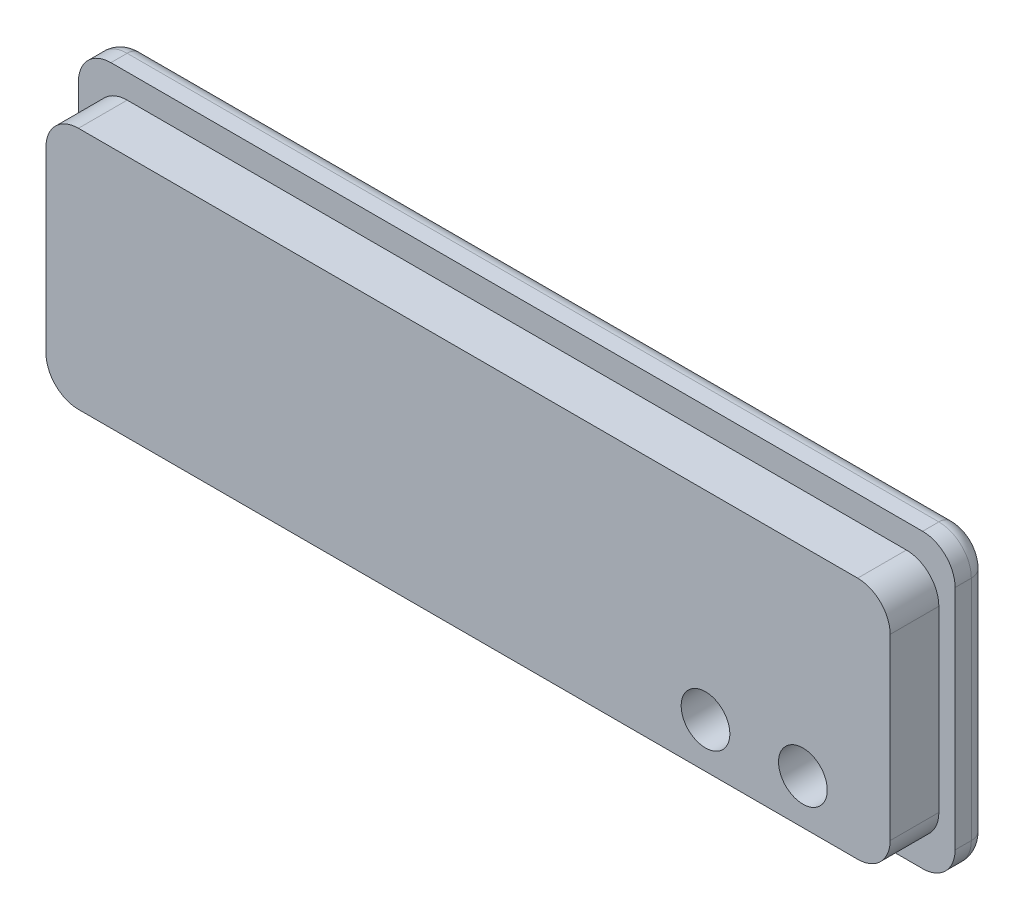
ISO-10303-21;
HEADER;
FILE_DESCRIPTION(('STEP AP214'),'2;1');
FILE_NAME('part.step','',(''),(''),'','','');
FILE_SCHEMA(('AUTOMOTIVE_DESIGN { 1 0 10303 214 1 1 1 1 }'));
ENDSEC;
DATA;
#1=APPLICATION_CONTEXT('core data for automotive mechanical design processes');
#2=APPLICATION_PROTOCOL_DEFINITION('international standard','automotive_design',2000,#1);
#3=PRODUCT_CONTEXT('',#1,'mechanical');
#4=PRODUCT('Part','Part','',(#3));
#5=PRODUCT_RELATED_PRODUCT_CATEGORY('part','',(#4));
#6=PRODUCT_DEFINITION_FORMATION('','',#4);
#7=PRODUCT_DEFINITION_CONTEXT('part definition',#1,'design');
#8=PRODUCT_DEFINITION('design','',#6,#7);
#9=PRODUCT_DEFINITION_SHAPE('','',#8);
#10=(LENGTH_UNIT() NAMED_UNIT(*) SI_UNIT(.MILLI.,.METRE.));
#11=(NAMED_UNIT(*) PLANE_ANGLE_UNIT() SI_UNIT($,.RADIAN.));
#12=(NAMED_UNIT(*) SI_UNIT($,.STERADIAN.) SOLID_ANGLE_UNIT());
#13=UNCERTAINTY_MEASURE_WITH_UNIT(LENGTH_MEASURE(1.E-05),#10,'distance_accuracy_value','');
#14=(GEOMETRIC_REPRESENTATION_CONTEXT(3) GLOBAL_UNCERTAINTY_ASSIGNED_CONTEXT((#13)) GLOBAL_UNIT_ASSIGNED_CONTEXT((#10,
#11,#12)) REPRESENTATION_CONTEXT('',''));
#15=CARTESIAN_POINT('',(0.,0.,0.));
#16=DIRECTION('',(0.,0.,1.));
#17=DIRECTION('',(1.,0.,0.));
#18=AXIS2_PLACEMENT_3D('',#15,#16,#17);
#19=CARTESIAN_POINT('',(-25.,-7.,2.));
#20=DIRECTION('',(0.,0.,1.));
#21=DIRECTION('',(1.,0.,0.));
#22=AXIS2_PLACEMENT_3D('',#19,#20,#21);
#23=PLANE('',#22);
#24=CARTESIAN_POINT('',(-25.,-7.,2.));
#25=DIRECTION('',(0.,0.,1.));
#26=DIRECTION('',(1.,0.,0.));
#27=AXIS2_PLACEMENT_3D('',#24,#25,#26);
#28=CIRCLE('',#27,2.);
#29=CARTESIAN_POINT('',(-27.,-6.99999999999999,2.));
#30=VERTEX_POINT('',#29);
#31=CARTESIAN_POINT('',(-25.,-9.,2.));
#32=VERTEX_POINT('',#31);
#33=EDGE_CURVE('E197',#30,#32,#28,.T.);
#34=ORIENTED_EDGE('',*,*,#33,.T.);
#35=DIRECTION('',(1.,0.,0.));
#36=VECTOR('',#35,1.);
#37=CARTESIAN_POINT('',(25.,-9.,2.));
#38=LINE('',#37,#36);
#39=CARTESIAN_POINT('',(25.,-9.,2.));
#40=VERTEX_POINT('',#39);
#41=EDGE_CURVE('E200',#32,#40,#38,.T.);
#42=ORIENTED_EDGE('',*,*,#41,.T.);
#43=CARTESIAN_POINT('',(25.,-7.,2.));
#44=DIRECTION('',(0.,0.,1.));
#45=DIRECTION('',(-1.,0.,0.));
#46=AXIS2_PLACEMENT_3D('',#43,#44,#45);
#47=CIRCLE('',#46,2.);
#48=CARTESIAN_POINT('',(27.,-6.99999999999999,2.));
#49=VERTEX_POINT('',#48);
#50=EDGE_CURVE('E207',#40,#49,#47,.T.);
#51=ORIENTED_EDGE('',*,*,#50,.T.);
#52=DIRECTION('',(0.,1.,0.));
#53=VECTOR('',#52,1.);
#54=CARTESIAN_POINT('',(27.,6.99999999999999,2.));
#55=LINE('',#54,#53);
#56=CARTESIAN_POINT('',(27.,6.99999999999999,2.));
#57=VERTEX_POINT('',#56);
#58=EDGE_CURVE('E209',#49,#57,#55,.T.);
#59=ORIENTED_EDGE('',*,*,#58,.T.);
#60=CARTESIAN_POINT('',(25.,7.,2.));
#61=DIRECTION('',(0.,0.,1.));
#62=DIRECTION('',(-1.,0.,0.));
#63=AXIS2_PLACEMENT_3D('',#60,#61,#62);
#64=CIRCLE('',#63,2.);
#65=CARTESIAN_POINT('',(25.,9.,2.));
#66=VERTEX_POINT('',#65);
#67=EDGE_CURVE('E211',#57,#66,#64,.T.);
#68=ORIENTED_EDGE('',*,*,#67,.T.);
#69=DIRECTION('',(-1.,0.,0.));
#70=VECTOR('',#69,1.);
#71=CARTESIAN_POINT('',(25.,9.,2.));
#72=LINE('',#71,#70);
#73=CARTESIAN_POINT('',(-25.,9.,2.));
#74=VERTEX_POINT('',#73);
#75=EDGE_CURVE('E213',#66,#74,#72,.T.);
#76=ORIENTED_EDGE('',*,*,#75,.T.);
#77=CARTESIAN_POINT('',(-25.,7.,2.));
#78=DIRECTION('',(0.,0.,1.));
#79=DIRECTION('',(1.,0.,0.));
#80=AXIS2_PLACEMENT_3D('',#77,#78,#79);
#81=CIRCLE('',#80,2.);
#82=CARTESIAN_POINT('',(-27.,6.99999999999999,2.));
#83=VERTEX_POINT('',#82);
#84=EDGE_CURVE('E215',#74,#83,#81,.T.);
#85=ORIENTED_EDGE('',*,*,#84,.T.);
#86=DIRECTION('',(0.,-1.,0.));
#87=VECTOR('',#86,1.);
#88=CARTESIAN_POINT('',(-27.,6.99999999999999,2.));
#89=LINE('',#88,#87);
#90=EDGE_CURVE('E217',#83,#30,#89,.T.);
#91=ORIENTED_EDGE('',*,*,#90,.T.);
#92=EDGE_LOOP('',(#34,#42,#51,#59,#68,#76,#85,#91));
#93=FACE_BOUND('',#92,.T.);
#94=DIRECTION('',(0.,1.,0.));
#95=VECTOR('',#94,1.);
#96=CARTESIAN_POINT('',(26.,-5.49999999999998,2.));
#97=LINE('',#96,#95);
#98=CARTESIAN_POINT('',(26.,-5.49999999999998,2.));
#99=VERTEX_POINT('',#98);
#100=CARTESIAN_POINT('',(26.,5.49999999999999,2.));
#101=VERTEX_POINT('',#100);
#102=EDGE_CURVE('E324',#99,#101,#97,.T.);
#103=ORIENTED_EDGE('',*,*,#102,.F.);
#104=CARTESIAN_POINT('',(24.,-5.5,2.));
#105=DIRECTION('',(0.,0.,1.));
#106=DIRECTION('',(1.,0.,0.));
#107=AXIS2_PLACEMENT_3D('',#104,#105,#106);
#108=CIRCLE('',#107,2.);
#109=CARTESIAN_POINT('',(24.,-7.5,2.));
#110=VERTEX_POINT('',#109);
#111=EDGE_CURVE('E195',#110,#99,#108,.T.);
#112=ORIENTED_EDGE('',*,*,#111,.F.);
#113=DIRECTION('',(1.,0.,0.));
#114=VECTOR('',#113,1.);
#115=CARTESIAN_POINT('',(24.,-7.5,2.));
#116=LINE('',#115,#114);
#117=CARTESIAN_POINT('',(-24.,-7.5,2.));
#118=VERTEX_POINT('',#117);
#119=EDGE_CURVE('E191',#118,#110,#116,.T.);
#120=ORIENTED_EDGE('',*,*,#119,.F.);
#121=CARTESIAN_POINT('',(-24.,-5.5,2.));
#122=DIRECTION('',(0.,0.,1.));
#123=DIRECTION('',(-1.,0.,0.));
#124=AXIS2_PLACEMENT_3D('',#121,#122,#123);
#125=CIRCLE('',#124,2.);
#126=CARTESIAN_POINT('',(-26.,-5.5,2.));
#127=VERTEX_POINT('',#126);
#128=EDGE_CURVE('E334',#127,#118,#125,.T.);
#129=ORIENTED_EDGE('',*,*,#128,.F.);
#130=DIRECTION('',(0.,-1.,0.));
#131=VECTOR('',#130,1.);
#132=CARTESIAN_POINT('',(-26.,-5.49999999999999,2.));
#133=LINE('',#132,#131);
#134=CARTESIAN_POINT('',(-26.,5.49999999999998,2.));
#135=VERTEX_POINT('',#134);
#136=EDGE_CURVE('E332',#135,#127,#133,.T.);
#137=ORIENTED_EDGE('',*,*,#136,.F.);
#138=CARTESIAN_POINT('',(-24.,5.5,2.));
#139=DIRECTION('',(0.,0.,1.));
#140=DIRECTION('',(1.,0.,0.));
#141=AXIS2_PLACEMENT_3D('',#138,#139,#140);
#142=CIRCLE('',#141,2.);
#143=CARTESIAN_POINT('',(-24.,7.5,2.));
#144=VERTEX_POINT('',#143);
#145=EDGE_CURVE('E330',#144,#135,#142,.T.);
#146=ORIENTED_EDGE('',*,*,#145,.F.);
#147=DIRECTION('',(-1.,0.,0.));
#148=VECTOR('',#147,1.);
#149=CARTESIAN_POINT('',(24.,7.5,2.));
#150=LINE('',#149,#148);
#151=CARTESIAN_POINT('',(24.,7.5,2.));
#152=VERTEX_POINT('',#151);
#153=EDGE_CURVE('E328',#152,#144,#150,.T.);
#154=ORIENTED_EDGE('',*,*,#153,.F.);
#155=CARTESIAN_POINT('',(24.,5.5,2.));
#156=DIRECTION('',(0.,0.,1.));
#157=DIRECTION('',(1.,0.,0.));
#158=AXIS2_PLACEMENT_3D('',#155,#156,#157);
#159=CIRCLE('',#158,2.);
#160=EDGE_CURVE('E326',#101,#152,#159,.T.);
#161=ORIENTED_EDGE('',*,*,#160,.F.);
#162=EDGE_LOOP('',(#103,#112,#120,#129,#137,#146,#154,#161));
#163=FACE_BOUND('',#162,.T.);
#164=ADVANCED_FACE('F33',(#93,#163),#23,.T.);
#165=CARTESIAN_POINT('',(-25.,-7.,2.));
#166=DIRECTION('',(0.,0.,-1.));
#167=DIRECTION('',(-1.,0.,0.));
#168=AXIS2_PLACEMENT_3D('',#165,#166,#167);
#169=CYLINDRICAL_SURFACE('',#168,2.);
#170=DIRECTION('',(0.,0.,-1.));
#171=VECTOR('',#170,1.);
#172=CARTESIAN_POINT('',(-27.,-6.99999999999999,2.));
#173=LINE('',#172,#171);
#174=CARTESIAN_POINT('',(-27.,-6.99999999999999,1.));
#175=VERTEX_POINT('',#174);
#176=EDGE_CURVE('E219',#30,#175,#173,.T.);
#177=ORIENTED_EDGE('',*,*,#176,.T.);
#178=CARTESIAN_POINT('',(-25.,-7.,1.));
#179=DIRECTION('',(0.,0.,1.));
#180=DIRECTION('',(1.,0.,0.));
#181=AXIS2_PLACEMENT_3D('',#178,#179,#180);
#182=CIRCLE('',#181,2.);
#183=CARTESIAN_POINT('',(-25.,-9.,1.));
#184=VERTEX_POINT('',#183);
#185=EDGE_CURVE('E274',#175,#184,#182,.T.);
#186=ORIENTED_EDGE('',*,*,#185,.T.);
#187=DIRECTION('',(0.,0.,-1.));
#188=VECTOR('',#187,1.);
#189=CARTESIAN_POINT('',(-25.,-9.,2.));
#190=LINE('',#189,#188);
#191=EDGE_CURVE('E237',#32,#184,#190,.T.);
#192=ORIENTED_EDGE('',*,*,#191,.F.);
#193=ORIENTED_EDGE('',*,*,#33,.F.);
#194=EDGE_LOOP('',(#177,#186,#192,#193));
#195=FACE_BOUND('',#194,.T.);
#196=ADVANCED_FACE('F382',(#195),#169,.T.);
#197=CARTESIAN_POINT('',(25.,-9.,2.));
#198=DIRECTION('',(0.,1.,0.));
#199=DIRECTION('',(0.,0.,1.));
#200=AXIS2_PLACEMENT_3D('',#197,#198,#199);
#201=PLANE('',#200);
#202=ORIENTED_EDGE('',*,*,#191,.T.);
#203=DIRECTION('',(1.,0.,0.));
#204=VECTOR('',#203,1.);
#205=CARTESIAN_POINT('',(25.,-9.,1.));
#206=LINE('',#205,#204);
#207=CARTESIAN_POINT('',(25.,-9.,1.));
#208=VERTEX_POINT('',#207);
#209=EDGE_CURVE('E272',#184,#208,#206,.T.);
#210=ORIENTED_EDGE('',*,*,#209,.T.);
#211=DIRECTION('',(0.,0.,-1.));
#212=VECTOR('',#211,1.);
#213=CARTESIAN_POINT('',(25.,-9.,2.));
#214=LINE('',#213,#212);
#215=EDGE_CURVE('E234',#40,#208,#214,.T.);
#216=ORIENTED_EDGE('',*,*,#215,.F.);
#217=ORIENTED_EDGE('',*,*,#41,.F.);
#218=EDGE_LOOP('',(#202,#210,#216,#217));
#219=FACE_BOUND('',#218,.T.);
#220=ADVANCED_FACE('F389',(#219),#201,.F.);
#221=CARTESIAN_POINT('',(25.,-7.,2.));
#222=DIRECTION('',(0.,0.,-1.));
#223=DIRECTION('',(-1.,0.,0.));
#224=AXIS2_PLACEMENT_3D('',#221,#222,#223);
#225=CYLINDRICAL_SURFACE('',#224,2.);
#226=ORIENTED_EDGE('',*,*,#215,.T.);
#227=CARTESIAN_POINT('',(25.,-7.,1.));
#228=DIRECTION('',(0.,0.,1.));
#229=DIRECTION('',(1.,0.,0.));
#230=AXIS2_PLACEMENT_3D('',#227,#228,#229);
#231=CIRCLE('',#230,2.);
#232=CARTESIAN_POINT('',(27.,-6.99999999999999,1.));
#233=VERTEX_POINT('',#232);
#234=EDGE_CURVE('E270',#208,#233,#231,.T.);
#235=ORIENTED_EDGE('',*,*,#234,.T.);
#236=DIRECTION('',(0.,0.,-1.));
#237=VECTOR('',#236,1.);
#238=CARTESIAN_POINT('',(27.,-6.99999999999999,2.));
#239=LINE('',#238,#237);
#240=EDGE_CURVE('E231',#49,#233,#239,.T.);
#241=ORIENTED_EDGE('',*,*,#240,.F.);
#242=ORIENTED_EDGE('',*,*,#50,.F.);
#243=EDGE_LOOP('',(#226,#235,#241,#242));
#244=FACE_BOUND('',#243,.T.);
#245=ADVANCED_FACE('F415',(#244),#225,.T.);
#246=CARTESIAN_POINT('',(27.,6.99999999999999,2.));
#247=DIRECTION('',(-1.,0.,0.));
#248=DIRECTION('',(0.,0.,1.));
#249=AXIS2_PLACEMENT_3D('',#246,#247,#248);
#250=PLANE('',#249);
#251=ORIENTED_EDGE('',*,*,#240,.T.);
#252=DIRECTION('',(0.,1.,0.));
#253=VECTOR('',#252,1.);
#254=CARTESIAN_POINT('',(27.,6.99999999999999,1.));
#255=LINE('',#254,#253);
#256=CARTESIAN_POINT('',(27.,6.99999999999999,1.));
#257=VERTEX_POINT('',#256);
#258=EDGE_CURVE('E268',#233,#257,#255,.T.);
#259=ORIENTED_EDGE('',*,*,#258,.T.);
#260=DIRECTION('',(0.,0.,-1.));
#261=VECTOR('',#260,1.);
#262=CARTESIAN_POINT('',(27.,6.99999999999999,2.));
#263=LINE('',#262,#261);
#264=EDGE_CURVE('E228',#57,#257,#263,.T.);
#265=ORIENTED_EDGE('',*,*,#264,.F.);
#266=ORIENTED_EDGE('',*,*,#58,.F.);
#267=EDGE_LOOP('',(#251,#259,#265,#266));
#268=FACE_BOUND('',#267,.T.);
#269=ADVANCED_FACE('F411',(#268),#250,.F.);
#270=CARTESIAN_POINT('',(25.,7.,2.));
#271=DIRECTION('',(0.,0.,-1.));
#272=DIRECTION('',(-1.,0.,0.));
#273=AXIS2_PLACEMENT_3D('',#270,#271,#272);
#274=CYLINDRICAL_SURFACE('',#273,2.);
#275=ORIENTED_EDGE('',*,*,#264,.T.);
#276=CARTESIAN_POINT('',(25.,7.,1.));
#277=DIRECTION('',(0.,0.,1.));
#278=DIRECTION('',(1.,0.,0.));
#279=AXIS2_PLACEMENT_3D('',#276,#277,#278);
#280=CIRCLE('',#279,2.);
#281=CARTESIAN_POINT('',(25.,9.,1.));
#282=VERTEX_POINT('',#281);
#283=EDGE_CURVE('E240',#257,#282,#280,.T.);
#284=ORIENTED_EDGE('',*,*,#283,.T.);
#285=DIRECTION('',(0.,0.,-1.));
#286=VECTOR('',#285,1.);
#287=CARTESIAN_POINT('',(25.,9.,2.));
#288=LINE('',#287,#286);
#289=EDGE_CURVE('E226',#66,#282,#288,.T.);
#290=ORIENTED_EDGE('',*,*,#289,.F.);
#291=ORIENTED_EDGE('',*,*,#67,.F.);
#292=EDGE_LOOP('',(#275,#284,#290,#291));
#293=FACE_BOUND('',#292,.T.);
#294=ADVANCED_FACE('F408',(#293),#274,.T.);
#295=CARTESIAN_POINT('',(25.,9.,2.));
#296=DIRECTION('',(0.,-1.,0.));
#297=DIRECTION('',(0.,0.,-1.));
#298=AXIS2_PLACEMENT_3D('',#295,#296,#297);
#299=PLANE('',#298);
#300=ORIENTED_EDGE('',*,*,#289,.T.);
#301=DIRECTION('',(-1.,0.,0.));
#302=VECTOR('',#301,1.);
#303=CARTESIAN_POINT('',(25.,9.,1.));
#304=LINE('',#303,#302);
#305=CARTESIAN_POINT('',(-25.,9.,1.));
#306=VERTEX_POINT('',#305);
#307=EDGE_CURVE('E11',#282,#306,#304,.T.);
#308=ORIENTED_EDGE('',*,*,#307,.T.);
#309=DIRECTION('',(0.,0.,-1.));
#310=VECTOR('',#309,1.);
#311=CARTESIAN_POINT('',(-25.,9.,2.));
#312=LINE('',#311,#310);
#313=EDGE_CURVE('E224',#74,#306,#312,.T.);
#314=ORIENTED_EDGE('',*,*,#313,.F.);
#315=ORIENTED_EDGE('',*,*,#75,.F.);
#316=EDGE_LOOP('',(#300,#308,#314,#315));
#317=FACE_BOUND('',#316,.T.);
#318=ADVANCED_FACE('F405',(#317),#299,.F.);
#319=CARTESIAN_POINT('',(-25.,7.,2.));
#320=DIRECTION('',(0.,0.,-1.));
#321=DIRECTION('',(-1.,0.,0.));
#322=AXIS2_PLACEMENT_3D('',#319,#320,#321);
#323=CYLINDRICAL_SURFACE('',#322,2.);
#324=ORIENTED_EDGE('',*,*,#313,.T.);
#325=CARTESIAN_POINT('',(-25.,7.,1.));
#326=DIRECTION('',(0.,0.,1.));
#327=DIRECTION('',(1.,0.,0.));
#328=AXIS2_PLACEMENT_3D('',#325,#326,#327);
#329=CIRCLE('',#328,2.);
#330=CARTESIAN_POINT('',(-27.,6.99999999999999,1.));
#331=VERTEX_POINT('',#330);
#332=EDGE_CURVE('E42',#306,#331,#329,.T.);
#333=ORIENTED_EDGE('',*,*,#332,.T.);
#334=DIRECTION('',(0.,0.,-1.));
#335=VECTOR('',#334,1.);
#336=CARTESIAN_POINT('',(-27.,6.99999999999999,2.));
#337=LINE('',#336,#335);
#338=EDGE_CURVE('E222',#83,#331,#337,.T.);
#339=ORIENTED_EDGE('',*,*,#338,.F.);
#340=ORIENTED_EDGE('',*,*,#84,.F.);
#341=EDGE_LOOP('',(#324,#333,#339,#340));
#342=FACE_BOUND('',#341,.T.);
#343=ADVANCED_FACE('F401',(#342),#323,.T.);
#344=CARTESIAN_POINT('',(-27.,6.99999999999999,2.));
#345=DIRECTION('',(1.,0.,0.));
#346=DIRECTION('',(0.,0.,-1.));
#347=AXIS2_PLACEMENT_3D('',#344,#345,#346);
#348=PLANE('',#347);
#349=ORIENTED_EDGE('',*,*,#338,.T.);
#350=DIRECTION('',(0.,-1.,0.));
#351=VECTOR('',#350,1.);
#352=CARTESIAN_POINT('',(-27.,6.99999999999999,1.));
#353=LINE('',#352,#351);
#354=EDGE_CURVE('E276',#331,#175,#353,.T.);
#355=ORIENTED_EDGE('',*,*,#354,.T.);
#356=ORIENTED_EDGE('',*,*,#176,.F.);
#357=ORIENTED_EDGE('',*,*,#90,.F.);
#358=EDGE_LOOP('',(#349,#355,#356,#357));
#359=FACE_BOUND('',#358,.T.);
#360=ADVANCED_FACE('F397',(#359),#348,.F.);
#361=CARTESIAN_POINT('',(-25.,-7.,0.));
#362=DIRECTION('',(0.,0.,1.));
#363=DIRECTION('',(1.,0.,0.));
#364=AXIS2_PLACEMENT_3D('',#361,#362,#363);
#365=PLANE('',#364);
#366=DIRECTION('',(-1.,0.,0.));
#367=VECTOR('',#366,1.);
#368=CARTESIAN_POINT('',(-25.,8.,0.));
#369=LINE('',#368,#367);
#370=CARTESIAN_POINT('',(-25.,8.,0.));
#371=VERTEX_POINT('',#370);
#372=CARTESIAN_POINT('',(25.,8.,0.));
#373=VERTEX_POINT('',#372);
#374=EDGE_CURVE('E251',#371,#373,#369,.F.);
#375=ORIENTED_EDGE('',*,*,#374,.T.);
#376=CARTESIAN_POINT('',(25.,7.,0.));
#377=DIRECTION('',(0.,0.,1.));
#378=DIRECTION('',(1.,0.,0.));
#379=AXIS2_PLACEMENT_3D('',#376,#377,#378);
#380=CIRCLE('',#379,1.);
#381=CARTESIAN_POINT('',(26.,6.99999999999999,0.));
#382=VERTEX_POINT('',#381);
#383=EDGE_CURVE('E265',#373,#382,#380,.F.);
#384=ORIENTED_EDGE('',*,*,#383,.T.);
#385=DIRECTION('',(0.,1.,0.));
#386=VECTOR('',#385,1.);
#387=CARTESIAN_POINT('',(26.,-7.,0.));
#388=LINE('',#387,#386);
#389=CARTESIAN_POINT('',(26.,-6.99999999999999,0.));
#390=VERTEX_POINT('',#389);
#391=EDGE_CURVE('E263',#382,#390,#388,.F.);
#392=ORIENTED_EDGE('',*,*,#391,.T.);
#393=CARTESIAN_POINT('',(25.,-7.,0.));
#394=DIRECTION('',(0.,0.,1.));
#395=DIRECTION('',(1.,0.,0.));
#396=AXIS2_PLACEMENT_3D('',#393,#394,#395);
#397=CIRCLE('',#396,1.);
#398=CARTESIAN_POINT('',(25.,-8.,0.));
#399=VERTEX_POINT('',#398);
#400=EDGE_CURVE('E261',#390,#399,#397,.F.);
#401=ORIENTED_EDGE('',*,*,#400,.T.);
#402=DIRECTION('',(1.,0.,0.));
#403=VECTOR('',#402,1.);
#404=CARTESIAN_POINT('',(-25.,-8.,0.));
#405=LINE('',#404,#403);
#406=CARTESIAN_POINT('',(-25.,-8.,0.));
#407=VERTEX_POINT('',#406);
#408=EDGE_CURVE('E259',#399,#407,#405,.F.);
#409=ORIENTED_EDGE('',*,*,#408,.T.);
#410=CARTESIAN_POINT('',(-25.,-7.,0.));
#411=DIRECTION('',(0.,0.,1.));
#412=DIRECTION('',(1.,0.,0.));
#413=AXIS2_PLACEMENT_3D('',#410,#411,#412);
#414=CIRCLE('',#413,1.);
#415=CARTESIAN_POINT('',(-26.,-6.99999999999999,0.));
#416=VERTEX_POINT('',#415);
#417=EDGE_CURVE('E257',#407,#416,#414,.F.);
#418=ORIENTED_EDGE('',*,*,#417,.T.);
#419=DIRECTION('',(0.,-1.,0.));
#420=VECTOR('',#419,1.);
#421=CARTESIAN_POINT('',(-26.,-7.,0.));
#422=LINE('',#421,#420);
#423=CARTESIAN_POINT('',(-26.,6.99999999999999,0.));
#424=VERTEX_POINT('',#423);
#425=EDGE_CURVE('E255',#416,#424,#422,.F.);
#426=ORIENTED_EDGE('',*,*,#425,.T.);
#427=CARTESIAN_POINT('',(-25.,7.,0.));
#428=DIRECTION('',(0.,0.,1.));
#429=DIRECTION('',(1.,0.,0.));
#430=AXIS2_PLACEMENT_3D('',#427,#428,#429);
#431=CIRCLE('',#430,1.);
#432=EDGE_CURVE('E253',#424,#371,#431,.F.);
#433=ORIENTED_EDGE('',*,*,#432,.T.);
#434=EDGE_LOOP('',(#375,#384,#392,#401,#409,#418,#426,#433));
#435=FACE_BOUND('',#434,.T.);
#436=CARTESIAN_POINT('',(14.6255991850719,-4.74532022003225,0.));
#437=DIRECTION('',(0.,0.,-1.));
#438=DIRECTION('',(-1.,0.,0.));
#439=AXIS2_PLACEMENT_3D('',#436,#437,#438);
#440=CIRCLE('',#439,1.5);
#441=CARTESIAN_POINT('',(13.1255991850719,-4.74532022003225,0.));
#442=VERTEX_POINT('',#441);
#443=EDGE_CURVE('E248',#442,#442,#440,.T.);
#444=ORIENTED_EDGE('',*,*,#443,.F.);
#445=EDGE_LOOP('',(#444));
#446=FACE_BOUND('',#445,.T.);
#447=CARTESIAN_POINT('',(20.6255991850719,-4.74532022003225,0.));
#448=DIRECTION('',(0.,0.,-1.));
#449=DIRECTION('',(-1.,0.,0.));
#450=AXIS2_PLACEMENT_3D('',#447,#448,#449);
#451=CIRCLE('',#450,1.5);
#452=CARTESIAN_POINT('',(19.1255991850719,-4.74532022003225,0.));
#453=VERTEX_POINT('',#452);
#454=EDGE_CURVE('E244',#453,#453,#451,.T.);
#455=ORIENTED_EDGE('',*,*,#454,.F.);
#456=EDGE_LOOP('',(#455));
#457=FACE_BOUND('',#456,.T.);
#458=ADVANCED_FACE('F394',(#435,#446,#457),#365,.F.);
#459=CARTESIAN_POINT('',(24.,-5.5,5.));
#460=DIRECTION('',(0.,0.,-1.));
#461=DIRECTION('',(-1.,0.,0.));
#462=AXIS2_PLACEMENT_3D('',#459,#460,#461);
#463=CYLINDRICAL_SURFACE('',#462,2.);
#464=ORIENTED_EDGE('',*,*,#111,.T.);
#465=DIRECTION('',(0.,0.,-1.));
#466=VECTOR('',#465,1.);
#467=CARTESIAN_POINT('',(26.,-5.49999999999998,5.));
#468=LINE('',#467,#466);
#469=CARTESIAN_POINT('',(26.,-5.49999999999998,5.));
#470=VERTEX_POINT('',#469);
#471=EDGE_CURVE('E175',#470,#99,#468,.T.);
#472=ORIENTED_EDGE('',*,*,#471,.F.);
#473=CARTESIAN_POINT('',(24.,-5.5,5.));
#474=DIRECTION('',(0.,0.,1.));
#475=DIRECTION('',(1.,0.,0.));
#476=AXIS2_PLACEMENT_3D('',#473,#474,#475);
#477=CIRCLE('',#476,2.);
#478=CARTESIAN_POINT('',(24.,-7.5,5.));
#479=VERTEX_POINT('',#478);
#480=EDGE_CURVE('E182',#479,#470,#477,.T.);
#481=ORIENTED_EDGE('',*,*,#480,.F.);
#482=DIRECTION('',(0.,0.,-1.));
#483=VECTOR('',#482,1.);
#484=CARTESIAN_POINT('',(24.,-7.5,5.));
#485=LINE('',#484,#483);
#486=EDGE_CURVE('E322',#479,#110,#485,.T.);
#487=ORIENTED_EDGE('',*,*,#486,.T.);
#488=EDGE_LOOP('',(#464,#472,#481,#487));
#489=FACE_BOUND('',#488,.T.);
#490=ADVANCED_FACE('F193',(#489),#463,.T.);
#491=CARTESIAN_POINT('',(26.,-5.49999999999998,5.));
#492=DIRECTION('',(-1.,0.,0.));
#493=DIRECTION('',(0.,0.,1.));
#494=AXIS2_PLACEMENT_3D('',#491,#492,#493);
#495=PLANE('',#494);
#496=ORIENTED_EDGE('',*,*,#102,.T.);
#497=DIRECTION('',(0.,0.,-1.));
#498=VECTOR('',#497,1.);
#499=CARTESIAN_POINT('',(26.,5.49999999999999,5.));
#500=LINE('',#499,#498);
#501=CARTESIAN_POINT('',(26.,5.49999999999999,5.));
#502=VERTEX_POINT('',#501);
#503=EDGE_CURVE('E178',#502,#101,#500,.T.);
#504=ORIENTED_EDGE('',*,*,#503,.F.);
#505=DIRECTION('',(0.,1.,0.));
#506=VECTOR('',#505,1.);
#507=CARTESIAN_POINT('',(26.,-5.49999999999998,5.));
#508=LINE('',#507,#506);
#509=EDGE_CURVE('E171',#470,#502,#508,.T.);
#510=ORIENTED_EDGE('',*,*,#509,.F.);
#511=ORIENTED_EDGE('',*,*,#471,.T.);
#512=EDGE_LOOP('',(#496,#504,#510,#511));
#513=FACE_BOUND('',#512,.T.);
#514=ADVANCED_FACE('F173',(#513),#495,.F.);
#515=CARTESIAN_POINT('',(24.,5.5,5.));
#516=DIRECTION('',(0.,0.,-1.));
#517=DIRECTION('',(-1.,0.,0.));
#518=AXIS2_PLACEMENT_3D('',#515,#516,#517);
#519=CYLINDRICAL_SURFACE('',#518,2.);
#520=ORIENTED_EDGE('',*,*,#160,.T.);
#521=DIRECTION('',(0.,0.,-1.));
#522=VECTOR('',#521,1.);
#523=CARTESIAN_POINT('',(24.,7.5,5.));
#524=LINE('',#523,#522);
#525=CARTESIAN_POINT('',(24.,7.5,5.));
#526=VERTEX_POINT('',#525);
#527=EDGE_CURVE('E202',#526,#152,#524,.T.);
#528=ORIENTED_EDGE('',*,*,#527,.F.);
#529=CARTESIAN_POINT('',(24.,5.5,5.));
#530=DIRECTION('',(0.,0.,1.));
#531=DIRECTION('',(1.,0.,0.));
#532=AXIS2_PLACEMENT_3D('',#529,#530,#531);
#533=CIRCLE('',#532,2.);
#534=EDGE_CURVE('E181',#502,#526,#533,.T.);
#535=ORIENTED_EDGE('',*,*,#534,.F.);
#536=ORIENTED_EDGE('',*,*,#503,.T.);
#537=EDGE_LOOP('',(#520,#528,#535,#536));
#538=FACE_BOUND('',#537,.T.);
#539=ADVANCED_FACE('F372',(#538),#519,.T.);
#540=CARTESIAN_POINT('',(24.,7.5,5.));
#541=DIRECTION('',(0.,-1.,0.));
#542=DIRECTION('',(1.,0.,0.));
#543=AXIS2_PLACEMENT_3D('',#540,#541,#542);
#544=PLANE('',#543);
#545=ORIENTED_EDGE('',*,*,#153,.T.);
#546=DIRECTION('',(0.,0.,-1.));
#547=VECTOR('',#546,1.);
#548=CARTESIAN_POINT('',(-24.,7.5,5.));
#549=LINE('',#548,#547);
#550=CARTESIAN_POINT('',(-24.,7.5,5.));
#551=VERTEX_POINT('',#550);
#552=EDGE_CURVE('E347',#551,#144,#549,.T.);
#553=ORIENTED_EDGE('',*,*,#552,.F.);
#554=DIRECTION('',(-1.,0.,0.));
#555=VECTOR('',#554,1.);
#556=CARTESIAN_POINT('',(24.,7.5,5.));
#557=LINE('',#556,#555);
#558=EDGE_CURVE('E313',#526,#551,#557,.T.);
#559=ORIENTED_EDGE('',*,*,#558,.F.);
#560=ORIENTED_EDGE('',*,*,#527,.T.);
#561=EDGE_LOOP('',(#545,#553,#559,#560));
#562=FACE_BOUND('',#561,.T.);
#563=ADVANCED_FACE('F354',(#562),#544,.F.);
#564=CARTESIAN_POINT('',(-24.,5.5,5.));
#565=DIRECTION('',(0.,0.,-1.));
#566=DIRECTION('',(-1.,0.,0.));
#567=AXIS2_PLACEMENT_3D('',#564,#565,#566);
#568=CYLINDRICAL_SURFACE('',#567,2.);
#569=ORIENTED_EDGE('',*,*,#145,.T.);
#570=DIRECTION('',(0.,0.,-1.));
#571=VECTOR('',#570,1.);
#572=CARTESIAN_POINT('',(-26.,5.49999999999998,5.));
#573=LINE('',#572,#571);
#574=CARTESIAN_POINT('',(-26.,5.49999999999998,5.));
#575=VERTEX_POINT('',#574);
#576=EDGE_CURVE('E344',#575,#135,#573,.T.);
#577=ORIENTED_EDGE('',*,*,#576,.F.);
#578=CARTESIAN_POINT('',(-24.,5.5,5.));
#579=DIRECTION('',(0.,0.,1.));
#580=DIRECTION('',(1.,0.,0.));
#581=AXIS2_PLACEMENT_3D('',#578,#579,#580);
#582=CIRCLE('',#581,2.);
#583=EDGE_CURVE('E315',#551,#575,#582,.T.);
#584=ORIENTED_EDGE('',*,*,#583,.F.);
#585=ORIENTED_EDGE('',*,*,#552,.T.);
#586=EDGE_LOOP('',(#569,#577,#584,#585));
#587=FACE_BOUND('',#586,.T.);
#588=ADVANCED_FACE('F364',(#587),#568,.T.);
#589=CARTESIAN_POINT('',(-26.,-5.49999999999999,5.));
#590=DIRECTION('',(1.,0.,0.));
#591=DIRECTION('',(0.,0.,-1.));
#592=AXIS2_PLACEMENT_3D('',#589,#590,#591);
#593=PLANE('',#592);
#594=ORIENTED_EDGE('',*,*,#136,.T.);
#595=DIRECTION('',(0.,0.,-1.));
#596=VECTOR('',#595,1.);
#597=CARTESIAN_POINT('',(-26.,-5.5,5.));
#598=LINE('',#597,#596);
#599=CARTESIAN_POINT('',(-26.,-5.5,5.));
#600=VERTEX_POINT('',#599);
#601=EDGE_CURVE('E341',#600,#127,#598,.T.);
#602=ORIENTED_EDGE('',*,*,#601,.F.);
#603=DIRECTION('',(0.,-1.,0.));
#604=VECTOR('',#603,1.);
#605=CARTESIAN_POINT('',(-26.,-5.49999999999999,5.));
#606=LINE('',#605,#604);
#607=EDGE_CURVE('E317',#575,#600,#606,.T.);
#608=ORIENTED_EDGE('',*,*,#607,.F.);
#609=ORIENTED_EDGE('',*,*,#576,.T.);
#610=EDGE_LOOP('',(#594,#602,#608,#609));
#611=FACE_BOUND('',#610,.T.);
#612=ADVANCED_FACE('F368',(#611),#593,.F.);
#613=CARTESIAN_POINT('',(-24.,-5.5,5.));
#614=DIRECTION('',(0.,0.,-1.));
#615=DIRECTION('',(-1.,0.,0.));
#616=AXIS2_PLACEMENT_3D('',#613,#614,#615);
#617=CYLINDRICAL_SURFACE('',#616,2.);
#618=ORIENTED_EDGE('',*,*,#128,.T.);
#619=DIRECTION('',(0.,0.,-1.));
#620=VECTOR('',#619,1.);
#621=CARTESIAN_POINT('',(-24.,-7.5,5.));
#622=LINE('',#621,#620);
#623=CARTESIAN_POINT('',(-24.,-7.5,5.));
#624=VERTEX_POINT('',#623);
#625=EDGE_CURVE('E339',#624,#118,#622,.T.);
#626=ORIENTED_EDGE('',*,*,#625,.F.);
#627=CARTESIAN_POINT('',(-24.,-5.5,5.));
#628=DIRECTION('',(0.,0.,1.));
#629=DIRECTION('',(-1.,0.,0.));
#630=AXIS2_PLACEMENT_3D('',#627,#628,#629);
#631=CIRCLE('',#630,2.);
#632=EDGE_CURVE('E319',#600,#624,#631,.T.);
#633=ORIENTED_EDGE('',*,*,#632,.F.);
#634=ORIENTED_EDGE('',*,*,#601,.T.);
#635=EDGE_LOOP('',(#618,#626,#633,#634));
#636=FACE_BOUND('',#635,.T.);
#637=ADVANCED_FACE('F504',(#636),#617,.T.);
#638=CARTESIAN_POINT('',(24.,-7.5,5.));
#639=DIRECTION('',(0.,1.,0.));
#640=DIRECTION('',(-1.,0.,0.));
#641=AXIS2_PLACEMENT_3D('',#638,#639,#640);
#642=PLANE('',#641);
#643=ORIENTED_EDGE('',*,*,#119,.T.);
#644=ORIENTED_EDGE('',*,*,#486,.F.);
#645=DIRECTION('',(1.,0.,0.));
#646=VECTOR('',#645,1.);
#647=CARTESIAN_POINT('',(24.,-7.5,5.));
#648=LINE('',#647,#646);
#649=EDGE_CURVE('E187',#624,#479,#648,.T.);
#650=ORIENTED_EDGE('',*,*,#649,.F.);
#651=ORIENTED_EDGE('',*,*,#625,.T.);
#652=EDGE_LOOP('',(#643,#644,#650,#651));
#653=FACE_BOUND('',#652,.T.);
#654=ADVANCED_FACE('F498',(#653),#642,.F.);
#655=CARTESIAN_POINT('',(24.,-5.5,5.));
#656=DIRECTION('',(0.,0.,1.));
#657=DIRECTION('',(1.,0.,0.));
#658=AXIS2_PLACEMENT_3D('',#655,#656,#657);
#659=PLANE('',#658);
#660=CARTESIAN_POINT('',(14.6255991850719,-4.74532022003225,5.));
#661=DIRECTION('',(0.,0.,1.));
#662=DIRECTION('',(1.,0.,0.));
#663=AXIS2_PLACEMENT_3D('',#660,#661,#662);
#664=CIRCLE('',#663,1.5);
#665=CARTESIAN_POINT('',(16.1255991850719,-4.74532022003225,5.));
#666=VERTEX_POINT('',#665);
#667=EDGE_CURVE('E245',#666,#666,#664,.T.);
#668=ORIENTED_EDGE('',*,*,#667,.F.);
#669=EDGE_LOOP('',(#668));
#670=FACE_BOUND('',#669,.T.);
#671=CARTESIAN_POINT('',(20.6255991850719,-4.74532022003225,5.));
#672=DIRECTION('',(0.,0.,1.));
#673=DIRECTION('',(1.,0.,0.));
#674=AXIS2_PLACEMENT_3D('',#671,#672,#673);
#675=CIRCLE('',#674,1.5);
#676=CARTESIAN_POINT('',(22.1255991850719,-4.74532022003225,5.));
#677=VERTEX_POINT('',#676);
#678=EDGE_CURVE('E241',#677,#677,#675,.T.);
#679=ORIENTED_EDGE('',*,*,#678,.F.);
#680=EDGE_LOOP('',(#679));
#681=FACE_BOUND('',#680,.T.);
#682=ORIENTED_EDGE('',*,*,#480,.T.);
#683=ORIENTED_EDGE('',*,*,#509,.T.);
#684=ORIENTED_EDGE('',*,*,#534,.T.);
#685=ORIENTED_EDGE('',*,*,#558,.T.);
#686=ORIENTED_EDGE('',*,*,#583,.T.);
#687=ORIENTED_EDGE('',*,*,#607,.T.);
#688=ORIENTED_EDGE('',*,*,#632,.T.);
#689=ORIENTED_EDGE('',*,*,#649,.T.);
#690=EDGE_LOOP('',(#682,#683,#684,#685,#686,#687,#688,#689));
#691=FACE_BOUND('',#690,.T.);
#692=ADVANCED_FACE('F185',(#670,#681,#691),#659,.T.);
#693=CARTESIAN_POINT('',(20.6255991850719,-4.74532022003225,7.));
#694=DIRECTION('',(0.,0.,-1.));
#695=DIRECTION('',(-1.,0.,0.));
#696=AXIS2_PLACEMENT_3D('',#693,#694,#695);
#697=CYLINDRICAL_SURFACE('',#696,1.5);
#698=ORIENTED_EDGE('',*,*,#678,.T.);
#699=EDGE_LOOP('',(#698));
#700=FACE_BOUND('',#699,.T.);
#701=ORIENTED_EDGE('',*,*,#454,.T.);
#702=EDGE_LOOP('',(#701));
#703=FACE_BOUND('',#702,.T.);
#704=ADVANCED_FACE('F455',(#700,#703),#697,.F.);
#705=CARTESIAN_POINT('',(14.6255991850719,-4.74532022003225,7.));
#706=DIRECTION('',(0.,0.,-1.));
#707=DIRECTION('',(-1.,0.,0.));
#708=AXIS2_PLACEMENT_3D('',#705,#706,#707);
#709=CYLINDRICAL_SURFACE('',#708,1.5);
#710=ORIENTED_EDGE('',*,*,#667,.T.);
#711=EDGE_LOOP('',(#710));
#712=FACE_BOUND('',#711,.T.);
#713=ORIENTED_EDGE('',*,*,#443,.T.);
#714=EDGE_LOOP('',(#713));
#715=FACE_BOUND('',#714,.T.);
#716=ADVANCED_FACE('F450',(#712,#715),#709,.F.);
#717=CARTESIAN_POINT('',(-25.,-7.,1.));
#718=DIRECTION('',(0.,0.,1.));
#719=DIRECTION('',(1.,0.,0.));
#720=AXIS2_PLACEMENT_3D('',#717,#718,#719);
#721=TOROIDAL_SURFACE('',#720,1.,1.);
#722=CARTESIAN_POINT('',(-26.,-6.99999999999999,1.));
#723=DIRECTION('',(0.,1.,0.));
#724=DIRECTION('',(-1.,0.,0.));
#725=AXIS2_PLACEMENT_3D('',#722,#723,#724);
#726=CIRCLE('',#725,1.);
#727=EDGE_CURVE('E294',#416,#175,#726,.T.);
#728=ORIENTED_EDGE('',*,*,#727,.F.);
#729=ORIENTED_EDGE('',*,*,#417,.F.);
#730=CARTESIAN_POINT('',(-25.,-8.,1.));
#731=DIRECTION('',(1.,0.,0.));
#732=DIRECTION('',(0.,1.,0.));
#733=AXIS2_PLACEMENT_3D('',#730,#731,#732);
#734=CIRCLE('',#733,1.);
#735=EDGE_CURVE('E37',#184,#407,#734,.T.);
#736=ORIENTED_EDGE('',*,*,#735,.F.);
#737=ORIENTED_EDGE('',*,*,#185,.F.);
#738=EDGE_LOOP('',(#728,#729,#736,#737));
#739=FACE_BOUND('',#738,.T.);
#740=ADVANCED_FACE('F35',(#739),#721,.T.);
#741=CARTESIAN_POINT('',(25.,-8.,1.));
#742=DIRECTION('',(1.,0.,0.));
#743=DIRECTION('',(0.,0.,-1.));
#744=AXIS2_PLACEMENT_3D('',#741,#742,#743);
#745=CYLINDRICAL_SURFACE('',#744,1.);
#746=ORIENTED_EDGE('',*,*,#735,.T.);
#747=ORIENTED_EDGE('',*,*,#408,.F.);
#748=CARTESIAN_POINT('',(25.,-8.,1.));
#749=DIRECTION('',(1.,0.,0.));
#750=DIRECTION('',(0.,0.,-1.));
#751=AXIS2_PLACEMENT_3D('',#748,#749,#750);
#752=CIRCLE('',#751,1.);
#753=EDGE_CURVE('E292',#208,#399,#752,.T.);
#754=ORIENTED_EDGE('',*,*,#753,.F.);
#755=ORIENTED_EDGE('',*,*,#209,.F.);
#756=EDGE_LOOP('',(#746,#747,#754,#755));
#757=FACE_BOUND('',#756,.T.);
#758=ADVANCED_FACE('F445',(#757),#745,.T.);
#759=CARTESIAN_POINT('',(-26.,6.99999999999999,1.));
#760=DIRECTION('',(0.,-1.,0.));
#761=DIRECTION('',(0.,0.,-1.));
#762=AXIS2_PLACEMENT_3D('',#759,#760,#761);
#763=CYLINDRICAL_SURFACE('',#762,1.);
#764=ORIENTED_EDGE('',*,*,#727,.T.);
#765=ORIENTED_EDGE('',*,*,#354,.F.);
#766=CARTESIAN_POINT('',(-26.,6.99999999999999,1.));
#767=DIRECTION('',(0.,1.,0.));
#768=DIRECTION('',(0.,0.,1.));
#769=AXIS2_PLACEMENT_3D('',#766,#767,#768);
#770=CIRCLE('',#769,1.);
#771=EDGE_CURVE('E289',#424,#331,#770,.T.);
#772=ORIENTED_EDGE('',*,*,#771,.F.);
#773=ORIENTED_EDGE('',*,*,#425,.F.);
#774=EDGE_LOOP('',(#764,#765,#772,#773));
#775=FACE_BOUND('',#774,.T.);
#776=ADVANCED_FACE('F442',(#775),#763,.T.);
#777=CARTESIAN_POINT('',(25.,-7.,1.));
#778=DIRECTION('',(0.,0.,1.));
#779=DIRECTION('',(1.,0.,0.));
#780=AXIS2_PLACEMENT_3D('',#777,#778,#779);
#781=TOROIDAL_SURFACE('',#780,1.,1.);
#782=ORIENTED_EDGE('',*,*,#753,.T.);
#783=ORIENTED_EDGE('',*,*,#400,.F.);
#784=CARTESIAN_POINT('',(26.,-6.99999999999999,1.));
#785=DIRECTION('',(0.,1.,0.));
#786=DIRECTION('',(0.,0.,1.));
#787=AXIS2_PLACEMENT_3D('',#784,#785,#786);
#788=CIRCLE('',#787,1.);
#789=EDGE_CURVE('E286',#233,#390,#788,.T.);
#790=ORIENTED_EDGE('',*,*,#789,.F.);
#791=ORIENTED_EDGE('',*,*,#234,.F.);
#792=EDGE_LOOP('',(#782,#783,#790,#791));
#793=FACE_BOUND('',#792,.T.);
#794=ADVANCED_FACE('F438',(#793),#781,.T.);
#795=CARTESIAN_POINT('',(-25.,7.,1.));
#796=DIRECTION('',(0.,0.,1.));
#797=DIRECTION('',(1.,0.,0.));
#798=AXIS2_PLACEMENT_3D('',#795,#796,#797);
#799=TOROIDAL_SURFACE('',#798,1.,1.);
#800=ORIENTED_EDGE('',*,*,#771,.T.);
#801=ORIENTED_EDGE('',*,*,#332,.F.);
#802=CARTESIAN_POINT('',(-25.,8.,1.));
#803=DIRECTION('',(1.,0.,0.));
#804=DIRECTION('',(0.,1.,0.));
#805=AXIS2_PLACEMENT_3D('',#802,#803,#804);
#806=CIRCLE('',#805,1.);
#807=EDGE_CURVE('E283',#371,#306,#806,.T.);
#808=ORIENTED_EDGE('',*,*,#807,.F.);
#809=ORIENTED_EDGE('',*,*,#432,.F.);
#810=EDGE_LOOP('',(#800,#801,#808,#809));
#811=FACE_BOUND('',#810,.T.);
#812=ADVANCED_FACE('F434',(#811),#799,.T.);
#813=CARTESIAN_POINT('',(26.,6.99999999999999,1.));
#814=DIRECTION('',(0.,1.,0.));
#815=DIRECTION('',(0.,0.,1.));
#816=AXIS2_PLACEMENT_3D('',#813,#814,#815);
#817=CYLINDRICAL_SURFACE('',#816,1.);
#818=ORIENTED_EDGE('',*,*,#789,.T.);
#819=ORIENTED_EDGE('',*,*,#391,.F.);
#820=CARTESIAN_POINT('',(26.,6.99999999999999,1.));
#821=DIRECTION('',(0.,1.,0.));
#822=DIRECTION('',(0.,0.,1.));
#823=AXIS2_PLACEMENT_3D('',#820,#821,#822);
#824=CIRCLE('',#823,1.);
#825=EDGE_CURVE('E281',#257,#382,#824,.T.);
#826=ORIENTED_EDGE('',*,*,#825,.F.);
#827=ORIENTED_EDGE('',*,*,#258,.F.);
#828=EDGE_LOOP('',(#818,#819,#826,#827));
#829=FACE_BOUND('',#828,.T.);
#830=ADVANCED_FACE('F430',(#829),#817,.T.);
#831=CARTESIAN_POINT('',(25.,8.,1.));
#832=DIRECTION('',(-1.,0.,0.));
#833=DIRECTION('',(0.,0.,1.));
#834=AXIS2_PLACEMENT_3D('',#831,#832,#833);
#835=CYLINDRICAL_SURFACE('',#834,1.);
#836=ORIENTED_EDGE('',*,*,#807,.T.);
#837=ORIENTED_EDGE('',*,*,#307,.F.);
#838=CARTESIAN_POINT('',(25.,8.,1.));
#839=DIRECTION('',(1.,0.,0.));
#840=DIRECTION('',(0.,1.,0.));
#841=AXIS2_PLACEMENT_3D('',#838,#839,#840);
#842=CIRCLE('',#841,1.);
#843=EDGE_CURVE('E279',#373,#282,#842,.T.);
#844=ORIENTED_EDGE('',*,*,#843,.F.);
#845=ORIENTED_EDGE('',*,*,#374,.F.);
#846=EDGE_LOOP('',(#836,#837,#844,#845));
#847=FACE_BOUND('',#846,.T.);
#848=ADVANCED_FACE('F426',(#847),#835,.T.);
#849=CARTESIAN_POINT('',(25.,7.,1.));
#850=DIRECTION('',(0.,0.,1.));
#851=DIRECTION('',(1.,0.,0.));
#852=AXIS2_PLACEMENT_3D('',#849,#850,#851);
#853=TOROIDAL_SURFACE('',#852,1.,1.);
#854=ORIENTED_EDGE('',*,*,#825,.T.);
#855=ORIENTED_EDGE('',*,*,#383,.F.);
#856=ORIENTED_EDGE('',*,*,#843,.T.);
#857=ORIENTED_EDGE('',*,*,#283,.F.);
#858=EDGE_LOOP('',(#854,#855,#856,#857));
#859=FACE_BOUND('',#858,.T.);
#860=ADVANCED_FACE('F423',(#859),#853,.T.);
#861=CLOSED_SHELL('',(#164,#196,#220,#245,#269,#294,#318,#343,#360,#458,#490,#514,#539,#563,
#588,#612,#637,#654,#692,#704,#716,#740,#758,#776,#794,#812,#830,#848,#860));
#862=MANIFOLD_SOLID_BREP('B2',#861);
#863=ADVANCED_BREP_SHAPE_REPRESENTATION('',(#18,#862),#14);
#864=SHAPE_DEFINITION_REPRESENTATION(#9,#863);
ENDSEC;
END-ISO-10303-21;
